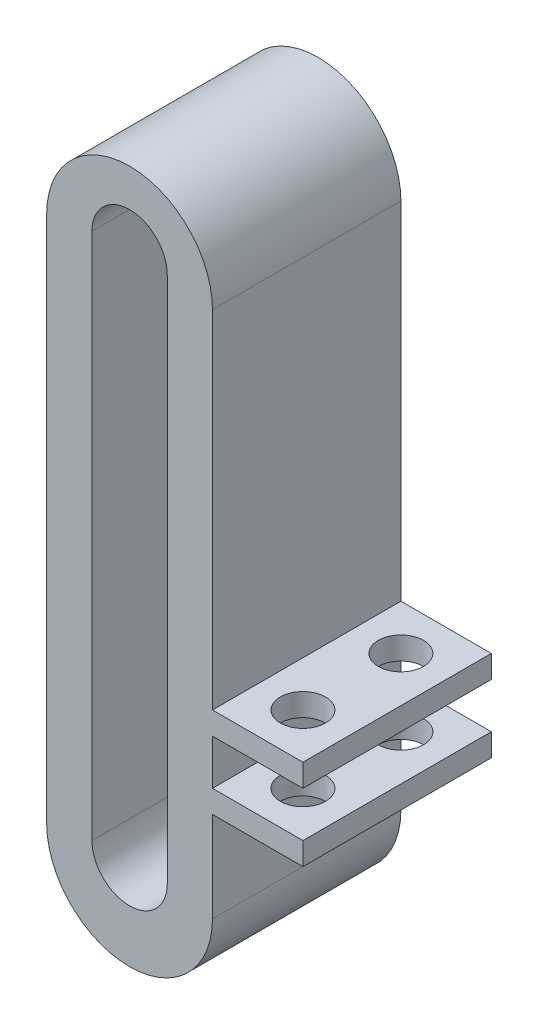
ISO-10303-21;
HEADER;
FILE_DESCRIPTION(('STEP AP214'),'2;1');
FILE_NAME('part.step','',(''),(''),'','','');
FILE_SCHEMA(('AUTOMOTIVE_DESIGN { 1 0 10303 214 1 1 1 1 }'));
ENDSEC;
DATA;
#1=APPLICATION_CONTEXT('core data for automotive mechanical design processes');
#2=APPLICATION_PROTOCOL_DEFINITION('international standard','automotive_design',2000,#1);
#3=PRODUCT_CONTEXT('',#1,'mechanical');
#4=PRODUCT('Part','Part','',(#3));
#5=PRODUCT_RELATED_PRODUCT_CATEGORY('part','',(#4));
#6=PRODUCT_DEFINITION_FORMATION('','',#4);
#7=PRODUCT_DEFINITION_CONTEXT('part definition',#1,'design');
#8=PRODUCT_DEFINITION('design','',#6,#7);
#9=PRODUCT_DEFINITION_SHAPE('','',#8);
#10=(LENGTH_UNIT() NAMED_UNIT(*) SI_UNIT(.MILLI.,.METRE.));
#11=(NAMED_UNIT(*) PLANE_ANGLE_UNIT() SI_UNIT($,.RADIAN.));
#12=(NAMED_UNIT(*) SI_UNIT($,.STERADIAN.) SOLID_ANGLE_UNIT());
#13=UNCERTAINTY_MEASURE_WITH_UNIT(LENGTH_MEASURE(1.E-05),#10,'distance_accuracy_value','');
#14=(GEOMETRIC_REPRESENTATION_CONTEXT(3) GLOBAL_UNCERTAINTY_ASSIGNED_CONTEXT((#13)) GLOBAL_UNIT_ASSIGNED_CONTEXT((#10,
#11,#12)) REPRESENTATION_CONTEXT('',''));
#15=CARTESIAN_POINT('',(0.,0.,0.));
#16=DIRECTION('',(0.,0.,1.));
#17=DIRECTION('',(1.,0.,0.));
#18=AXIS2_PLACEMENT_3D('',#15,#16,#17);
#19=CARTESIAN_POINT('',(5.49999999999977,17.,12.5));
#20=DIRECTION('',(-1.,0.,0.));
#21=DIRECTION('',(0.,0.,1.));
#22=AXIS2_PLACEMENT_3D('',#19,#20,#21);
#23=PLANE('',#22);
#24=DIRECTION('',(0.,0.,-1.));
#25=VECTOR('',#24,1.);
#26=CARTESIAN_POINT('',(5.49999999999977,-7.5,12.5));
#27=LINE('',#26,#25);
#28=CARTESIAN_POINT('',(5.49999999999977,-7.5,12.5));
#29=VERTEX_POINT('',#28);
#30=CARTESIAN_POINT('',(5.49999999999977,-7.5,0.));
#31=VERTEX_POINT('',#30);
#32=EDGE_CURVE('E214',#29,#31,#27,.T.);
#33=ORIENTED_EDGE('',*,*,#32,.F.);
#34=DIRECTION('',(0.,1.,0.));
#35=VECTOR('',#34,1.);
#36=CARTESIAN_POINT('',(5.49999999999977,17.,12.5));
#37=LINE('',#36,#35);
#38=CARTESIAN_POINT('',(5.49999999999977,-10.5,12.5));
#39=VERTEX_POINT('',#38);
#40=EDGE_CURVE('E313',#39,#29,#37,.T.);
#41=ORIENTED_EDGE('',*,*,#40,.F.);
#42=DIRECTION('',(0.,0.,1.));
#43=VECTOR('',#42,1.);
#44=CARTESIAN_POINT('',(5.49999999999977,-10.5,12.5));
#45=LINE('',#44,#43);
#46=CARTESIAN_POINT('',(5.49999999999977,-10.5,0.));
#47=VERTEX_POINT('',#46);
#48=EDGE_CURVE('E246',#47,#39,#45,.T.);
#49=ORIENTED_EDGE('',*,*,#48,.F.);
#50=DIRECTION('',(0.,1.,0.));
#51=VECTOR('',#50,1.);
#52=CARTESIAN_POINT('',(5.49999999999977,17.,0.));
#53=LINE('',#52,#51);
#54=EDGE_CURVE('E322',#47,#31,#53,.T.);
#55=ORIENTED_EDGE('',*,*,#54,.T.);
#56=EDGE_LOOP('',(#33,#41,#49,#55));
#57=FACE_BOUND('',#56,.T.);
#58=ADVANCED_FACE('F35',(#57),#23,.F.);
#59=DIRECTION('',(0.,0.,1.));
#60=VECTOR('',#59,1.);
#61=CARTESIAN_POINT('',(5.49999999999977,-6.,12.5));
#62=LINE('',#61,#60);
#63=CARTESIAN_POINT('',(5.49999999999977,-6.,0.));
#64=VERTEX_POINT('',#63);
#65=CARTESIAN_POINT('',(5.49999999999977,-6.,12.5));
#66=VERTEX_POINT('',#65);
#67=EDGE_CURVE('E219',#64,#66,#62,.T.);
#68=ORIENTED_EDGE('',*,*,#67,.F.);
#69=CARTESIAN_POINT('',(5.49999999999977,17.,0.));
#70=VERTEX_POINT('',#69);
#71=EDGE_CURVE('E320',#64,#70,#53,.T.);
#72=ORIENTED_EDGE('',*,*,#71,.T.);
#73=DIRECTION('',(0.,0.,-1.));
#74=VECTOR('',#73,1.);
#75=CARTESIAN_POINT('',(5.49999999999977,17.,12.5));
#76=LINE('',#75,#74);
#77=CARTESIAN_POINT('',(5.49999999999977,17.,12.5));
#78=VERTEX_POINT('',#77);
#79=EDGE_CURVE('E312',#78,#70,#76,.T.);
#80=ORIENTED_EDGE('',*,*,#79,.F.);
#81=EDGE_CURVE('E308',#66,#78,#37,.T.);
#82=ORIENTED_EDGE('',*,*,#81,.F.);
#83=EDGE_LOOP('',(#68,#72,#80,#82));
#84=FACE_BOUND('',#83,.T.);
#85=ADVANCED_FACE('F363',(#84),#23,.F.);
#86=DIRECTION('',(0.,0.,-1.));
#87=VECTOR('',#86,1.);
#88=CARTESIAN_POINT('',(5.49999999999977,-12.,12.5));
#89=LINE('',#88,#87);
#90=CARTESIAN_POINT('',(5.49999999999977,-12.,12.5));
#91=VERTEX_POINT('',#90);
#92=CARTESIAN_POINT('',(5.49999999999977,-12.,0.));
#93=VERTEX_POINT('',#92);
#94=EDGE_CURVE('E241',#91,#93,#89,.T.);
#95=ORIENTED_EDGE('',*,*,#94,.F.);
#96=CARTESIAN_POINT('',(5.49999999999977,-18.,12.5));
#97=VERTEX_POINT('',#96);
#98=EDGE_CURVE('E309',#97,#91,#37,.T.);
#99=ORIENTED_EDGE('',*,*,#98,.F.);
#100=DIRECTION('',(0.,0.,-1.));
#101=VECTOR('',#100,1.);
#102=CARTESIAN_POINT('',(5.49999999999977,-18.,12.5));
#103=LINE('',#102,#101);
#104=CARTESIAN_POINT('',(5.49999999999977,-18.,0.));
#105=VERTEX_POINT('',#104);
#106=EDGE_CURVE('E325',#97,#105,#103,.T.);
#107=ORIENTED_EDGE('',*,*,#106,.T.);
#108=EDGE_CURVE('E304',#105,#93,#53,.T.);
#109=ORIENTED_EDGE('',*,*,#108,.T.);
#110=EDGE_LOOP('',(#95,#99,#107,#109));
#111=FACE_BOUND('',#110,.T.);
#112=ADVANCED_FACE('F366',(#111),#23,.F.);
#113=CARTESIAN_POINT('',(1.07932326270932E-12,17.0000060128267,12.5));
#114=DIRECTION('',(0.,0.,1.));
#115=DIRECTION('',(1.,0.,0.));
#116=AXIS2_PLACEMENT_3D('',#113,#114,#115);
#117=PLANE('',#116);
#118=CARTESIAN_POINT('',(1.07932326270932E-12,17.0000060128267,12.5));
#119=DIRECTION('',(0.,0.,1.));
#120=DIRECTION('',(1.,0.,0.));
#121=AXIS2_PLACEMENT_3D('',#118,#119,#120);
#122=CIRCLE('',#121,5.50000000000145);
#123=CARTESIAN_POINT('',(-5.49999999999985,17.0000060128267,12.5));
#124=VERTEX_POINT('',#123);
#125=EDGE_CURVE('E300',#78,#124,#122,.T.);
#126=ORIENTED_EDGE('',*,*,#125,.T.);
#127=DIRECTION('',(0.,-1.,0.));
#128=VECTOR('',#127,1.);
#129=CARTESIAN_POINT('',(-5.49999999999985,17.0000060128267,12.5));
#130=LINE('',#129,#128);
#131=CARTESIAN_POINT('',(-5.50000000000022,-17.9999945979283,12.5));
#132=VERTEX_POINT('',#131);
#133=EDGE_CURVE('E303',#124,#132,#130,.T.);
#134=ORIENTED_EDGE('',*,*,#133,.T.);
#135=CARTESIAN_POINT('',(9.21138165743685E-13,-17.9999945979283,12.5));
#136=DIRECTION('',(0.,0.,1.));
#137=DIRECTION('',(1.,0.,0.));
#138=AXIS2_PLACEMENT_3D('',#135,#136,#137);
#139=CIRCLE('',#138,5.50000000000114);
#140=EDGE_CURVE('E306',#132,#97,#139,.T.);
#141=ORIENTED_EDGE('',*,*,#140,.T.);
#142=ORIENTED_EDGE('',*,*,#98,.T.);
#143=DIRECTION('',(-1.,0.,0.));
#144=VECTOR('',#143,1.);
#145=CARTESIAN_POINT('',(11.4999999999998,-12.,12.5));
#146=LINE('',#145,#144);
#147=CARTESIAN_POINT('',(11.4999999999998,-12.,12.5));
#148=VERTEX_POINT('',#147);
#149=EDGE_CURVE('E265',#148,#91,#146,.T.);
#150=ORIENTED_EDGE('',*,*,#149,.F.);
#151=DIRECTION('',(0.,-1.,0.));
#152=VECTOR('',#151,1.);
#153=CARTESIAN_POINT('',(11.4999999999998,-12.,12.5));
#154=LINE('',#153,#152);
#155=CARTESIAN_POINT('',(11.4999999999998,-10.5,12.5));
#156=VERTEX_POINT('',#155);
#157=EDGE_CURVE('E242',#156,#148,#154,.T.);
#158=ORIENTED_EDGE('',*,*,#157,.F.);
#159=DIRECTION('',(-1.,0.,0.));
#160=VECTOR('',#159,1.);
#161=CARTESIAN_POINT('',(11.4999999999998,-10.5,12.5));
#162=LINE('',#161,#160);
#163=EDGE_CURVE('E252',#156,#39,#162,.T.);
#164=ORIENTED_EDGE('',*,*,#163,.T.);
#165=ORIENTED_EDGE('',*,*,#40,.T.);
#166=DIRECTION('',(-1.,0.,0.));
#167=VECTOR('',#166,1.);
#168=CARTESIAN_POINT('',(11.4999999999998,-7.5,12.5));
#169=LINE('',#168,#167);
#170=CARTESIAN_POINT('',(11.4999999999998,-7.5,12.5));
#171=VERTEX_POINT('',#170);
#172=EDGE_CURVE('E238',#171,#29,#169,.T.);
#173=ORIENTED_EDGE('',*,*,#172,.F.);
#174=DIRECTION('',(0.,-1.,0.));
#175=VECTOR('',#174,1.);
#176=CARTESIAN_POINT('',(11.4999999999998,-6.,12.5));
#177=LINE('',#176,#175);
#178=CARTESIAN_POINT('',(11.4999999999998,-6.,12.5));
#179=VERTEX_POINT('',#178);
#180=EDGE_CURVE('E215',#179,#171,#177,.T.);
#181=ORIENTED_EDGE('',*,*,#180,.F.);
#182=DIRECTION('',(-1.,0.,0.));
#183=VECTOR('',#182,1.);
#184=CARTESIAN_POINT('',(11.4999999999998,-6.,12.5));
#185=LINE('',#184,#183);
#186=EDGE_CURVE('E225',#179,#66,#185,.T.);
#187=ORIENTED_EDGE('',*,*,#186,.T.);
#188=ORIENTED_EDGE('',*,*,#81,.T.);
#189=EDGE_LOOP('',(#126,#134,#141,#142,#150,#158,#164,#165,#173,#181,#187,#188));
#190=FACE_BOUND('',#189,.T.);
#191=DIRECTION('',(0.,-1.,0.));
#192=VECTOR('',#191,1.);
#193=CARTESIAN_POINT('',(-2.49999999999984,17.5,12.5));
#194=LINE('',#193,#192);
#195=CARTESIAN_POINT('',(-2.49999999999984,17.5,12.5));
#196=VERTEX_POINT('',#195);
#197=CARTESIAN_POINT('',(-2.49999999999984,-17.5,12.5));
#198=VERTEX_POINT('',#197);
#199=EDGE_CURVE('E271',#196,#198,#194,.T.);
#200=ORIENTED_EDGE('',*,*,#199,.F.);
#201=CARTESIAN_POINT('',(0.,17.5,12.5));
#202=DIRECTION('',(0.,0.,1.));
#203=DIRECTION('',(1.,0.,0.));
#204=AXIS2_PLACEMENT_3D('',#201,#202,#203);
#205=CIRCLE('',#204,2.49999999999983);
#206=CARTESIAN_POINT('',(2.49999999999982,17.5,12.5));
#207=VERTEX_POINT('',#206);
#208=EDGE_CURVE('E269',#207,#196,#205,.T.);
#209=ORIENTED_EDGE('',*,*,#208,.F.);
#210=DIRECTION('',(0.,1.,0.));
#211=VECTOR('',#210,1.);
#212=CARTESIAN_POINT('',(2.49999999999982,17.5,12.5));
#213=LINE('',#212,#211);
#214=CARTESIAN_POINT('',(2.49999999999983,-17.5,12.5));
#215=VERTEX_POINT('',#214);
#216=EDGE_CURVE('E277',#215,#207,#213,.T.);
#217=ORIENTED_EDGE('',*,*,#216,.F.);
#218=CARTESIAN_POINT('',(0.,-17.5,12.5));
#219=DIRECTION('',(0.,0.,1.));
#220=DIRECTION('',(1.,0.,0.));
#221=AXIS2_PLACEMENT_3D('',#218,#219,#220);
#222=CIRCLE('',#221,2.49999999999984);
#223=EDGE_CURVE('E274',#198,#215,#222,.T.);
#224=ORIENTED_EDGE('',*,*,#223,.F.);
#225=EDGE_LOOP('',(#200,#209,#217,#224));
#226=FACE_BOUND('',#225,.T.);
#227=ADVANCED_FACE('F374',(#190,#226),#117,.T.);
#228=CARTESIAN_POINT('',(1.07932326270932E-12,17.0000060128267,0.));
#229=DIRECTION('',(0.,0.,1.));
#230=DIRECTION('',(1.,0.,0.));
#231=AXIS2_PLACEMENT_3D('',#228,#229,#230);
#232=PLANE('',#231);
#233=CARTESIAN_POINT('',(1.07932326270932E-12,17.0000060128267,0.));
#234=DIRECTION('',(0.,0.,1.));
#235=DIRECTION('',(1.,0.,0.));
#236=AXIS2_PLACEMENT_3D('',#233,#234,#235);
#237=CIRCLE('',#236,5.50000000000145);
#238=CARTESIAN_POINT('',(-5.49999999999985,17.0000060128267,0.));
#239=VERTEX_POINT('',#238);
#240=EDGE_CURVE('E299',#70,#239,#237,.T.);
#241=ORIENTED_EDGE('',*,*,#240,.F.);
#242=ORIENTED_EDGE('',*,*,#71,.F.);
#243=DIRECTION('',(-1.,0.,0.));
#244=VECTOR('',#243,1.);
#245=CARTESIAN_POINT('',(11.4999999999998,-6.,0.));
#246=LINE('',#245,#244);
#247=CARTESIAN_POINT('',(11.4999999999998,-6.,0.));
#248=VERTEX_POINT('',#247);
#249=EDGE_CURVE('E232',#248,#64,#246,.T.);
#250=ORIENTED_EDGE('',*,*,#249,.F.);
#251=DIRECTION('',(0.,1.,0.));
#252=VECTOR('',#251,1.);
#253=CARTESIAN_POINT('',(11.4999999999998,-6.,0.));
#254=LINE('',#253,#252);
#255=CARTESIAN_POINT('',(11.4999999999998,-7.5,0.));
#256=VERTEX_POINT('',#255);
#257=EDGE_CURVE('E221',#256,#248,#254,.T.);
#258=ORIENTED_EDGE('',*,*,#257,.F.);
#259=DIRECTION('',(-1.,0.,0.));
#260=VECTOR('',#259,1.);
#261=CARTESIAN_POINT('',(11.4999999999998,-7.5,0.));
#262=LINE('',#261,#260);
#263=EDGE_CURVE('E235',#256,#31,#262,.T.);
#264=ORIENTED_EDGE('',*,*,#263,.T.);
#265=ORIENTED_EDGE('',*,*,#54,.F.);
#266=DIRECTION('',(-1.,0.,0.));
#267=VECTOR('',#266,1.);
#268=CARTESIAN_POINT('',(11.4999999999998,-10.5,0.));
#269=LINE('',#268,#267);
#270=CARTESIAN_POINT('',(11.4999999999998,-10.5,0.));
#271=VERTEX_POINT('',#270);
#272=EDGE_CURVE('E259',#271,#47,#269,.T.);
#273=ORIENTED_EDGE('',*,*,#272,.F.);
#274=DIRECTION('',(0.,1.,0.));
#275=VECTOR('',#274,1.);
#276=CARTESIAN_POINT('',(11.4999999999998,-12.,0.));
#277=LINE('',#276,#275);
#278=CARTESIAN_POINT('',(11.4999999999998,-12.,0.));
#279=VERTEX_POINT('',#278);
#280=EDGE_CURVE('E248',#279,#271,#277,.T.);
#281=ORIENTED_EDGE('',*,*,#280,.F.);
#282=DIRECTION('',(-1.,0.,0.));
#283=VECTOR('',#282,1.);
#284=CARTESIAN_POINT('',(11.4999999999998,-12.,0.));
#285=LINE('',#284,#283);
#286=EDGE_CURVE('E262',#279,#93,#285,.T.);
#287=ORIENTED_EDGE('',*,*,#286,.T.);
#288=ORIENTED_EDGE('',*,*,#108,.F.);
#289=CARTESIAN_POINT('',(9.21138165743685E-13,-17.9999945979283,0.));
#290=DIRECTION('',(0.,0.,1.));
#291=DIRECTION('',(1.,0.,0.));
#292=AXIS2_PLACEMENT_3D('',#289,#290,#291);
#293=CIRCLE('',#292,5.50000000000114);
#294=CARTESIAN_POINT('',(-5.50000000000022,-17.9999945979283,0.));
#295=VERTEX_POINT('',#294);
#296=EDGE_CURVE('E318',#295,#105,#293,.T.);
#297=ORIENTED_EDGE('',*,*,#296,.F.);
#298=DIRECTION('',(0.,-1.,0.));
#299=VECTOR('',#298,1.);
#300=CARTESIAN_POINT('',(-5.49999999999985,17.0000060128267,0.));
#301=LINE('',#300,#299);
#302=EDGE_CURVE('E316',#239,#295,#301,.T.);
#303=ORIENTED_EDGE('',*,*,#302,.F.);
#304=EDGE_LOOP('',(#241,#242,#250,#258,#264,#265,#273,#281,#287,#288,#297,#303));
#305=FACE_BOUND('',#304,.T.);
#306=CARTESIAN_POINT('',(0.,17.5,0.));
#307=DIRECTION('',(0.,0.,1.));
#308=DIRECTION('',(1.,0.,0.));
#309=AXIS2_PLACEMENT_3D('',#306,#307,#308);
#310=CIRCLE('',#309,2.49999999999983);
#311=CARTESIAN_POINT('',(2.49999999999982,17.5,0.));
#312=VERTEX_POINT('',#311);
#313=CARTESIAN_POINT('',(-2.49999999999984,17.5,0.));
#314=VERTEX_POINT('',#313);
#315=EDGE_CURVE('E268',#312,#314,#310,.T.);
#316=ORIENTED_EDGE('',*,*,#315,.T.);
#317=DIRECTION('',(0.,-1.,0.));
#318=VECTOR('',#317,1.);
#319=CARTESIAN_POINT('',(-2.49999999999984,17.5,0.));
#320=LINE('',#319,#318);
#321=CARTESIAN_POINT('',(-2.49999999999984,-17.5,0.));
#322=VERTEX_POINT('',#321);
#323=EDGE_CURVE('E282',#314,#322,#320,.T.);
#324=ORIENTED_EDGE('',*,*,#323,.T.);
#325=CARTESIAN_POINT('',(0.,-17.5,0.));
#326=DIRECTION('',(0.,0.,1.));
#327=DIRECTION('',(1.,0.,0.));
#328=AXIS2_PLACEMENT_3D('',#325,#326,#327);
#329=CIRCLE('',#328,2.49999999999984);
#330=CARTESIAN_POINT('',(2.49999999999983,-17.5,0.));
#331=VERTEX_POINT('',#330);
#332=EDGE_CURVE('E285',#322,#331,#329,.T.);
#333=ORIENTED_EDGE('',*,*,#332,.T.);
#334=DIRECTION('',(0.,1.,0.));
#335=VECTOR('',#334,1.);
#336=CARTESIAN_POINT('',(2.49999999999982,17.5,0.));
#337=LINE('',#336,#335);
#338=EDGE_CURVE('E272',#331,#312,#337,.T.);
#339=ORIENTED_EDGE('',*,*,#338,.T.);
#340=EDGE_LOOP('',(#316,#324,#333,#339));
#341=FACE_BOUND('',#340,.T.);
#342=ADVANCED_FACE('F379',(#305,#341),#232,.F.);
#343=CARTESIAN_POINT('',(1.07932326270932E-12,17.0000060128267,12.5));
#344=DIRECTION('',(0.,0.,-1.));
#345=DIRECTION('',(-1.,0.,0.));
#346=AXIS2_PLACEMENT_3D('',#343,#344,#345);
#347=CYLINDRICAL_SURFACE('',#346,5.50000000000145);
#348=ORIENTED_EDGE('',*,*,#240,.T.);
#349=DIRECTION('',(0.,0.,-1.));
#350=VECTOR('',#349,1.);
#351=CARTESIAN_POINT('',(-5.49999999999985,17.0000060128267,12.5));
#352=LINE('',#351,#350);
#353=EDGE_CURVE('E331',#124,#239,#352,.T.);
#354=ORIENTED_EDGE('',*,*,#353,.F.);
#355=ORIENTED_EDGE('',*,*,#125,.F.);
#356=ORIENTED_EDGE('',*,*,#79,.T.);
#357=EDGE_LOOP('',(#348,#354,#355,#356));
#358=FACE_BOUND('',#357,.T.);
#359=ADVANCED_FACE('F37',(#358),#347,.T.);
#360=CARTESIAN_POINT('',(-5.49999999999985,17.0000060128267,12.5));
#361=DIRECTION('',(1.,0.,0.));
#362=DIRECTION('',(0.,1.,0.));
#363=AXIS2_PLACEMENT_3D('',#360,#361,#362);
#364=PLANE('',#363);
#365=ORIENTED_EDGE('',*,*,#302,.T.);
#366=DIRECTION('',(0.,0.,-1.));
#367=VECTOR('',#366,1.);
#368=CARTESIAN_POINT('',(-5.50000000000022,-17.9999945979283,12.5));
#369=LINE('',#368,#367);
#370=EDGE_CURVE('E328',#132,#295,#369,.T.);
#371=ORIENTED_EDGE('',*,*,#370,.F.);
#372=ORIENTED_EDGE('',*,*,#133,.F.);
#373=ORIENTED_EDGE('',*,*,#353,.T.);
#374=EDGE_LOOP('',(#365,#371,#372,#373));
#375=FACE_BOUND('',#374,.T.);
#376=ADVANCED_FACE('F417',(#375),#364,.F.);
#377=CARTESIAN_POINT('',(9.21138165743685E-13,-17.9999945979283,12.5));
#378=DIRECTION('',(0.,0.,-1.));
#379=DIRECTION('',(-1.,0.,0.));
#380=AXIS2_PLACEMENT_3D('',#377,#378,#379);
#381=CYLINDRICAL_SURFACE('',#380,5.50000000000114);
#382=DIRECTION('',(0.,0.,-1.));
#383=VECTOR('',#382,1.);
#384=CARTESIAN_POINT('',(-0.49999999999985,-23.477220172981,12.5));
#385=LINE('',#384,#383);
#386=CARTESIAN_POINT('',(-0.499999999999851,-23.477220172981,3.75));
#387=VERTEX_POINT('',#386);
#388=CARTESIAN_POINT('',(-0.499999999999851,-23.477220172981,8.75));
#389=VERTEX_POINT('',#388);
#390=EDGE_CURVE('E180',#387,#389,#385,.F.);
#391=ORIENTED_EDGE('',*,*,#390,.T.);
#392=CARTESIAN_POINT('',(9.21138165743685E-13,-17.9999945979283,8.75));
#393=DIRECTION('',(0.,0.,1.));
#394=DIRECTION('',(1.,0.,0.));
#395=AXIS2_PLACEMENT_3D('',#392,#393,#394);
#396=CIRCLE('',#395,5.50000000000114);
#397=CARTESIAN_POINT('',(0.50000000000015,-23.4772201729812,8.75));
#398=VERTEX_POINT('',#397);
#399=EDGE_CURVE('E50',#389,#398,#396,.T.);
#400=ORIENTED_EDGE('',*,*,#399,.T.);
#401=DIRECTION('',(0.,0.,-1.));
#402=VECTOR('',#401,1.);
#403=CARTESIAN_POINT('',(0.50000000000015,-23.4772201729812,12.5));
#404=LINE('',#403,#402);
#405=CARTESIAN_POINT('',(0.500000000000149,-23.4772201729812,3.75));
#406=VERTEX_POINT('',#405);
#407=EDGE_CURVE('E173',#398,#406,#404,.T.);
#408=ORIENTED_EDGE('',*,*,#407,.T.);
#409=CARTESIAN_POINT('',(9.21138165743685E-13,-17.9999945979283,3.75));
#410=DIRECTION('',(0.,0.,-1.));
#411=DIRECTION('',(-1.,0.,0.));
#412=AXIS2_PLACEMENT_3D('',#409,#410,#411);
#413=CIRCLE('',#412,5.50000000000114);
#414=EDGE_CURVE('E187',#406,#387,#413,.T.);
#415=ORIENTED_EDGE('',*,*,#414,.T.);
#416=EDGE_LOOP('',(#391,#400,#408,#415));
#417=FACE_BOUND('',#416,.T.);
#418=ORIENTED_EDGE('',*,*,#296,.T.);
#419=ORIENTED_EDGE('',*,*,#106,.F.);
#420=ORIENTED_EDGE('',*,*,#140,.F.);
#421=ORIENTED_EDGE('',*,*,#370,.T.);
#422=EDGE_LOOP('',(#418,#419,#420,#421));
#423=FACE_BOUND('',#422,.T.);
#424=ADVANCED_FACE('F185',(#417,#423),#381,.T.);
#425=CARTESIAN_POINT('',(0.,17.5,12.5));
#426=DIRECTION('',(0.,0.,-1.));
#427=DIRECTION('',(-1.,0.,0.));
#428=AXIS2_PLACEMENT_3D('',#425,#426,#427);
#429=CYLINDRICAL_SURFACE('',#428,2.49999999999983);
#430=ORIENTED_EDGE('',*,*,#315,.F.);
#431=DIRECTION('',(0.,0.,-1.));
#432=VECTOR('',#431,1.);
#433=CARTESIAN_POINT('',(2.49999999999982,17.5,12.5));
#434=LINE('',#433,#432);
#435=EDGE_CURVE('E279',#207,#312,#434,.T.);
#436=ORIENTED_EDGE('',*,*,#435,.F.);
#437=ORIENTED_EDGE('',*,*,#208,.T.);
#438=DIRECTION('',(0.,0.,-1.));
#439=VECTOR('',#438,1.);
#440=CARTESIAN_POINT('',(-2.49999999999984,17.5,12.5));
#441=LINE('',#440,#439);
#442=EDGE_CURVE('E296',#196,#314,#441,.T.);
#443=ORIENTED_EDGE('',*,*,#442,.T.);
#444=EDGE_LOOP('',(#430,#436,#437,#443));
#445=FACE_BOUND('',#444,.T.);
#446=ADVANCED_FACE('F455',(#445),#429,.F.);
#447=CARTESIAN_POINT('',(-2.49999999999984,17.5,12.5));
#448=DIRECTION('',(1.,0.,0.));
#449=DIRECTION('',(0.,0.,-1.));
#450=AXIS2_PLACEMENT_3D('',#447,#448,#449);
#451=PLANE('',#450);
#452=ORIENTED_EDGE('',*,*,#323,.F.);
#453=ORIENTED_EDGE('',*,*,#442,.F.);
#454=ORIENTED_EDGE('',*,*,#199,.T.);
#455=DIRECTION('',(0.,0.,-1.));
#456=VECTOR('',#455,1.);
#457=CARTESIAN_POINT('',(-2.49999999999984,-17.5,12.5));
#458=LINE('',#457,#456);
#459=EDGE_CURVE('E294',#198,#322,#458,.T.);
#460=ORIENTED_EDGE('',*,*,#459,.T.);
#461=EDGE_LOOP('',(#452,#453,#454,#460));
#462=FACE_BOUND('',#461,.T.);
#463=ADVANCED_FACE('F452',(#462),#451,.T.);
#464=CARTESIAN_POINT('',(0.,-17.5,12.5));
#465=DIRECTION('',(0.,0.,-1.));
#466=DIRECTION('',(-1.,0.,0.));
#467=AXIS2_PLACEMENT_3D('',#464,#465,#466);
#468=CYLINDRICAL_SURFACE('',#467,2.49999999999984);
#469=DIRECTION('',(0.,0.,-1.));
#470=VECTOR('',#469,1.);
#471=CARTESIAN_POINT('',(-0.49999999999985,-19.949489742783,12.5));
#472=LINE('',#471,#470);
#473=CARTESIAN_POINT('',(-0.499999999999851,-19.949489742783,3.75));
#474=VERTEX_POINT('',#473);
#475=CARTESIAN_POINT('',(-0.499999999999851,-19.949489742783,8.75));
#476=VERTEX_POINT('',#475);
#477=EDGE_CURVE('E11',#474,#476,#472,.F.);
#478=ORIENTED_EDGE('',*,*,#477,.F.);
#479=CARTESIAN_POINT('',(0.,-17.5,3.75));
#480=DIRECTION('',(0.,0.,-1.));
#481=DIRECTION('',(-1.,0.,0.));
#482=AXIS2_PLACEMENT_3D('',#479,#480,#481);
#483=CIRCLE('',#482,2.49999999999984);
#484=CARTESIAN_POINT('',(0.500000000000149,-19.949489742783,3.75));
#485=VERTEX_POINT('',#484);
#486=EDGE_CURVE('E43',#485,#474,#483,.T.);
#487=ORIENTED_EDGE('',*,*,#486,.F.);
#488=DIRECTION('',(0.,0.,-1.));
#489=VECTOR('',#488,1.);
#490=CARTESIAN_POINT('',(0.50000000000015,-19.949489742783,12.5));
#491=LINE('',#490,#489);
#492=CARTESIAN_POINT('',(0.50000000000015,-19.949489742783,8.75));
#493=VERTEX_POINT('',#492);
#494=EDGE_CURVE('E338',#493,#485,#491,.T.);
#495=ORIENTED_EDGE('',*,*,#494,.F.);
#496=CARTESIAN_POINT('',(0.,-17.5,8.75));
#497=DIRECTION('',(0.,0.,1.));
#498=DIRECTION('',(1.,0.,0.));
#499=AXIS2_PLACEMENT_3D('',#496,#497,#498);
#500=CIRCLE('',#499,2.49999999999984);
#501=EDGE_CURVE('E333',#476,#493,#500,.T.);
#502=ORIENTED_EDGE('',*,*,#501,.F.);
#503=EDGE_LOOP('',(#478,#487,#495,#502));
#504=FACE_BOUND('',#503,.T.);
#505=ORIENTED_EDGE('',*,*,#332,.F.);
#506=ORIENTED_EDGE('',*,*,#459,.F.);
#507=ORIENTED_EDGE('',*,*,#223,.T.);
#508=DIRECTION('',(0.,0.,-1.));
#509=VECTOR('',#508,1.);
#510=CARTESIAN_POINT('',(2.49999999999983,-17.5,12.5));
#511=LINE('',#510,#509);
#512=EDGE_CURVE('E292',#215,#331,#511,.T.);
#513=ORIENTED_EDGE('',*,*,#512,.T.);
#514=EDGE_LOOP('',(#505,#506,#507,#513));
#515=FACE_BOUND('',#514,.T.);
#516=ADVANCED_FACE('F348',(#504,#515),#468,.F.);
#517=CARTESIAN_POINT('',(2.49999999999982,17.5,12.5));
#518=DIRECTION('',(-1.,0.,0.));
#519=DIRECTION('',(0.,-1.,0.));
#520=AXIS2_PLACEMENT_3D('',#517,#518,#519);
#521=PLANE('',#520);
#522=ORIENTED_EDGE('',*,*,#338,.F.);
#523=ORIENTED_EDGE('',*,*,#512,.F.);
#524=ORIENTED_EDGE('',*,*,#216,.T.);
#525=ORIENTED_EDGE('',*,*,#435,.T.);
#526=EDGE_LOOP('',(#522,#523,#524,#525));
#527=FACE_BOUND('',#526,.T.);
#528=ADVANCED_FACE('F445',(#527),#521,.T.);
#529=CARTESIAN_POINT('',(11.4999999999998,-12.,12.5));
#530=DIRECTION('',(0.,1.,0.));
#531=DIRECTION('',(-1.,0.,0.));
#532=AXIS2_PLACEMENT_3D('',#529,#530,#531);
#533=PLANE('',#532);
#534=CARTESIAN_POINT('',(8.49999999999977,-12.,3.));
#535=DIRECTION('',(0.,1.,0.));
#536=DIRECTION('',(-1.,0.,0.));
#537=AXIS2_PLACEMENT_3D('',#534,#535,#536);
#538=CIRCLE('',#537,1.5);
#539=CARTESIAN_POINT('',(6.99999999999977,-12.,3.));
#540=VERTEX_POINT('',#539);
#541=EDGE_CURVE('E211',#540,#540,#538,.T.);
#542=ORIENTED_EDGE('',*,*,#541,.T.);
#543=EDGE_LOOP('',(#542));
#544=FACE_BOUND('',#543,.T.);
#545=CARTESIAN_POINT('',(8.49999999999977,-12.,9.5));
#546=DIRECTION('',(0.,1.,0.));
#547=DIRECTION('',(-1.,0.,0.));
#548=AXIS2_PLACEMENT_3D('',#545,#546,#547);
#549=CIRCLE('',#548,1.5);
#550=CARTESIAN_POINT('',(6.99999999999977,-12.,9.5));
#551=VERTEX_POINT('',#550);
#552=EDGE_CURVE('E201',#551,#551,#549,.T.);
#553=ORIENTED_EDGE('',*,*,#552,.T.);
#554=EDGE_LOOP('',(#553));
#555=FACE_BOUND('',#554,.T.);
#556=ORIENTED_EDGE('',*,*,#94,.T.);
#557=ORIENTED_EDGE('',*,*,#286,.F.);
#558=DIRECTION('',(0.,0.,-1.));
#559=VECTOR('',#558,1.);
#560=CARTESIAN_POINT('',(11.4999999999998,-12.,12.5));
#561=LINE('',#560,#559);
#562=EDGE_CURVE('E245',#148,#279,#561,.T.);
#563=ORIENTED_EDGE('',*,*,#562,.F.);
#564=ORIENTED_EDGE('',*,*,#149,.T.);
#565=EDGE_LOOP('',(#556,#557,#563,#564));
#566=FACE_BOUND('',#565,.T.);
#567=ADVANCED_FACE('F391',(#544,#555,#566),#533,.F.);
#568=CARTESIAN_POINT('',(11.4999999999998,-10.5,12.5));
#569=DIRECTION('',(0.,-1.,0.));
#570=DIRECTION('',(1.,0.,0.));
#571=AXIS2_PLACEMENT_3D('',#568,#569,#570);
#572=PLANE('',#571);
#573=CARTESIAN_POINT('',(8.49999999999977,-10.5,3.));
#574=DIRECTION('',(0.,-1.,0.));
#575=DIRECTION('',(1.,0.,0.));
#576=AXIS2_PLACEMENT_3D('',#573,#574,#575);
#577=CIRCLE('',#576,1.5);
#578=CARTESIAN_POINT('',(9.99999999999977,-10.5,3.));
#579=VERTEX_POINT('',#578);
#580=EDGE_CURVE('E208',#579,#579,#577,.T.);
#581=ORIENTED_EDGE('',*,*,#580,.T.);
#582=EDGE_LOOP('',(#581));
#583=FACE_BOUND('',#582,.T.);
#584=CARTESIAN_POINT('',(8.49999999999977,-10.5,9.5));
#585=DIRECTION('',(0.,-1.,0.));
#586=DIRECTION('',(1.,0.,0.));
#587=AXIS2_PLACEMENT_3D('',#584,#585,#586);
#588=CIRCLE('',#587,1.5);
#589=CARTESIAN_POINT('',(9.99999999999977,-10.5,9.5));
#590=VERTEX_POINT('',#589);
#591=EDGE_CURVE('E198',#590,#590,#588,.T.);
#592=ORIENTED_EDGE('',*,*,#591,.T.);
#593=EDGE_LOOP('',(#592));
#594=FACE_BOUND('',#593,.T.);
#595=ORIENTED_EDGE('',*,*,#48,.T.);
#596=ORIENTED_EDGE('',*,*,#163,.F.);
#597=DIRECTION('',(0.,0.,1.));
#598=VECTOR('',#597,1.);
#599=CARTESIAN_POINT('',(11.4999999999998,-10.5,12.5));
#600=LINE('',#599,#598);
#601=EDGE_CURVE('E250',#271,#156,#600,.T.);
#602=ORIENTED_EDGE('',*,*,#601,.F.);
#603=ORIENTED_EDGE('',*,*,#272,.T.);
#604=EDGE_LOOP('',(#595,#596,#602,#603));
#605=FACE_BOUND('',#604,.T.);
#606=ADVANCED_FACE('F400',(#583,#594,#605),#572,.F.);
#607=CARTESIAN_POINT('',(11.4999999999998,0.,0.));
#608=DIRECTION('',(-1.,0.,0.));
#609=DIRECTION('',(0.,0.,1.));
#610=AXIS2_PLACEMENT_3D('',#607,#608,#609);
#611=PLANE('',#610);
#612=ORIENTED_EDGE('',*,*,#157,.T.);
#613=ORIENTED_EDGE('',*,*,#562,.T.);
#614=ORIENTED_EDGE('',*,*,#280,.T.);
#615=ORIENTED_EDGE('',*,*,#601,.T.);
#616=EDGE_LOOP('',(#612,#613,#614,#615));
#617=FACE_BOUND('',#616,.T.);
#618=ADVANCED_FACE('F394',(#617),#611,.F.);
#619=CARTESIAN_POINT('',(11.4999999999998,-7.5,12.5));
#620=DIRECTION('',(0.,1.,0.));
#621=DIRECTION('',(-1.,0.,0.));
#622=AXIS2_PLACEMENT_3D('',#619,#620,#621);
#623=PLANE('',#622);
#624=CARTESIAN_POINT('',(8.49999999999977,-7.5,3.));
#625=DIRECTION('',(0.,1.,0.));
#626=DIRECTION('',(-1.,0.,0.));
#627=AXIS2_PLACEMENT_3D('',#624,#625,#626);
#628=CIRCLE('',#627,1.5);
#629=CARTESIAN_POINT('',(6.99999999999977,-7.5,3.));
#630=VERTEX_POINT('',#629);
#631=EDGE_CURVE('E205',#630,#630,#628,.T.);
#632=ORIENTED_EDGE('',*,*,#631,.T.);
#633=EDGE_LOOP('',(#632));
#634=FACE_BOUND('',#633,.T.);
#635=CARTESIAN_POINT('',(8.49999999999977,-7.5,9.5));
#636=DIRECTION('',(0.,1.,0.));
#637=DIRECTION('',(-1.,0.,0.));
#638=AXIS2_PLACEMENT_3D('',#635,#636,#637);
#639=CIRCLE('',#638,1.5);
#640=CARTESIAN_POINT('',(6.99999999999977,-7.5,9.5));
#641=VERTEX_POINT('',#640);
#642=EDGE_CURVE('E191',#641,#641,#639,.T.);
#643=ORIENTED_EDGE('',*,*,#642,.T.);
#644=EDGE_LOOP('',(#643));
#645=FACE_BOUND('',#644,.T.);
#646=ORIENTED_EDGE('',*,*,#32,.T.);
#647=ORIENTED_EDGE('',*,*,#263,.F.);
#648=DIRECTION('',(0.,0.,-1.));
#649=VECTOR('',#648,1.);
#650=CARTESIAN_POINT('',(11.4999999999998,-7.5,12.5));
#651=LINE('',#650,#649);
#652=EDGE_CURVE('E218',#171,#256,#651,.T.);
#653=ORIENTED_EDGE('',*,*,#652,.F.);
#654=ORIENTED_EDGE('',*,*,#172,.T.);
#655=EDGE_LOOP('',(#646,#647,#653,#654));
#656=FACE_BOUND('',#655,.T.);
#657=ADVANCED_FACE('F426',(#634,#645,#656),#623,.F.);
#658=CARTESIAN_POINT('',(11.4999999999998,-6.,12.5));
#659=DIRECTION('',(0.,-1.,0.));
#660=DIRECTION('',(1.,0.,0.));
#661=AXIS2_PLACEMENT_3D('',#658,#659,#660);
#662=PLANE('',#661);
#663=CARTESIAN_POINT('',(8.49999999999977,-6.,3.));
#664=DIRECTION('',(0.,-1.,0.));
#665=DIRECTION('',(1.,0.,0.));
#666=AXIS2_PLACEMENT_3D('',#663,#664,#665);
#667=CIRCLE('',#666,1.5);
#668=CARTESIAN_POINT('',(9.99999999999977,-6.,3.));
#669=VERTEX_POINT('',#668);
#670=EDGE_CURVE('E204',#669,#669,#667,.T.);
#671=ORIENTED_EDGE('',*,*,#670,.T.);
#672=EDGE_LOOP('',(#671));
#673=FACE_BOUND('',#672,.T.);
#674=CARTESIAN_POINT('',(8.49999999999977,-6.,9.5));
#675=DIRECTION('',(0.,-1.,0.));
#676=DIRECTION('',(1.,0.,0.));
#677=AXIS2_PLACEMENT_3D('',#674,#675,#676);
#678=CIRCLE('',#677,1.5);
#679=CARTESIAN_POINT('',(9.99999999999977,-6.,9.5));
#680=VERTEX_POINT('',#679);
#681=EDGE_CURVE('E188',#680,#680,#678,.T.);
#682=ORIENTED_EDGE('',*,*,#681,.T.);
#683=EDGE_LOOP('',(#682));
#684=FACE_BOUND('',#683,.T.);
#685=ORIENTED_EDGE('',*,*,#67,.T.);
#686=ORIENTED_EDGE('',*,*,#186,.F.);
#687=DIRECTION('',(0.,0.,1.));
#688=VECTOR('',#687,1.);
#689=CARTESIAN_POINT('',(11.4999999999998,-6.,12.5));
#690=LINE('',#689,#688);
#691=EDGE_CURVE('E223',#248,#179,#690,.T.);
#692=ORIENTED_EDGE('',*,*,#691,.F.);
#693=ORIENTED_EDGE('',*,*,#249,.T.);
#694=EDGE_LOOP('',(#685,#686,#692,#693));
#695=FACE_BOUND('',#694,.T.);
#696=ADVANCED_FACE('F421',(#673,#684,#695),#662,.F.);
#697=CARTESIAN_POINT('',(11.4999999999998,0.,0.));
#698=DIRECTION('',(1.,0.,0.));
#699=DIRECTION('',(0.,0.,-1.));
#700=AXIS2_PLACEMENT_3D('',#697,#698,#699);
#701=PLANE('',#700);
#702=ORIENTED_EDGE('',*,*,#180,.T.);
#703=ORIENTED_EDGE('',*,*,#652,.T.);
#704=ORIENTED_EDGE('',*,*,#257,.T.);
#705=ORIENTED_EDGE('',*,*,#691,.T.);
#706=EDGE_LOOP('',(#702,#703,#704,#705));
#707=FACE_BOUND('',#706,.T.);
#708=ADVANCED_FACE('F424',(#707),#701,.T.);
#709=CARTESIAN_POINT('',(8.49999999999977,-23.4999945979295,9.5));
#710=DIRECTION('',(0.,1.,0.));
#711=DIRECTION('',(-1.,0.,0.));
#712=AXIS2_PLACEMENT_3D('',#709,#710,#711);
#713=CYLINDRICAL_SURFACE('',#712,1.5);
#714=ORIENTED_EDGE('',*,*,#681,.F.);
#715=EDGE_LOOP('',(#714));
#716=FACE_BOUND('',#715,.T.);
#717=ORIENTED_EDGE('',*,*,#642,.F.);
#718=EDGE_LOOP('',(#717));
#719=FACE_BOUND('',#718,.T.);
#720=ADVANCED_FACE('F513',(#716,#719),#713,.F.);
#721=CARTESIAN_POINT('',(8.49999999999977,-23.4999945979295,3.));
#722=DIRECTION('',(0.,1.,0.));
#723=DIRECTION('',(-1.,0.,0.));
#724=AXIS2_PLACEMENT_3D('',#721,#722,#723);
#725=CYLINDRICAL_SURFACE('',#724,1.5);
#726=ORIENTED_EDGE('',*,*,#670,.F.);
#727=EDGE_LOOP('',(#726));
#728=FACE_BOUND('',#727,.T.);
#729=ORIENTED_EDGE('',*,*,#631,.F.);
#730=EDGE_LOOP('',(#729));
#731=FACE_BOUND('',#730,.T.);
#732=ADVANCED_FACE('F525',(#728,#731),#725,.F.);
#733=ORIENTED_EDGE('',*,*,#591,.F.);
#734=EDGE_LOOP('',(#733));
#735=FACE_BOUND('',#734,.T.);
#736=ORIENTED_EDGE('',*,*,#552,.F.);
#737=EDGE_LOOP('',(#736));
#738=FACE_BOUND('',#737,.T.);
#739=ADVANCED_FACE('F528',(#735,#738),#713,.F.);
#740=ORIENTED_EDGE('',*,*,#580,.F.);
#741=EDGE_LOOP('',(#740));
#742=FACE_BOUND('',#741,.T.);
#743=ORIENTED_EDGE('',*,*,#541,.F.);
#744=EDGE_LOOP('',(#743));
#745=FACE_BOUND('',#744,.T.);
#746=ADVANCED_FACE('F535',(#742,#745),#725,.F.);
#747=CARTESIAN_POINT('',(-0.499999999999851,-23.4999945979295,3.75));
#748=DIRECTION('',(-1.,0.,0.));
#749=DIRECTION('',(0.,0.,1.));
#750=AXIS2_PLACEMENT_3D('',#747,#748,#749);
#751=PLANE('',#750);
#752=DIRECTION('',(0.,1.,0.));
#753=VECTOR('',#752,1.);
#754=CARTESIAN_POINT('',(-0.499999999999851,-23.4999945979295,3.75));
#755=LINE('',#754,#753);
#756=EDGE_CURVE('E174',#387,#474,#755,.T.);
#757=ORIENTED_EDGE('',*,*,#756,.T.);
#758=ORIENTED_EDGE('',*,*,#477,.T.);
#759=DIRECTION('',(0.,1.,0.));
#760=VECTOR('',#759,1.);
#761=CARTESIAN_POINT('',(-0.499999999999851,-23.4999945979295,8.75));
#762=LINE('',#761,#760);
#763=EDGE_CURVE('E57',#389,#476,#762,.T.);
#764=ORIENTED_EDGE('',*,*,#763,.F.);
#765=ORIENTED_EDGE('',*,*,#390,.F.);
#766=EDGE_LOOP('',(#757,#758,#764,#765));
#767=FACE_BOUND('',#766,.T.);
#768=ADVANCED_FACE('F179',(#767),#751,.F.);
#769=CARTESIAN_POINT('',(-0.499999999999851,-23.4999945979295,3.75));
#770=DIRECTION('',(0.,0.,-1.));
#771=DIRECTION('',(-1.,0.,0.));
#772=AXIS2_PLACEMENT_3D('',#769,#770,#771);
#773=PLANE('',#772);
#774=DIRECTION('',(0.,1.,0.));
#775=VECTOR('',#774,1.);
#776=CARTESIAN_POINT('',(0.500000000000149,-23.4999945979295,3.75));
#777=LINE('',#776,#775);
#778=EDGE_CURVE('E344',#406,#485,#777,.T.);
#779=ORIENTED_EDGE('',*,*,#778,.T.);
#780=ORIENTED_EDGE('',*,*,#486,.T.);
#781=ORIENTED_EDGE('',*,*,#756,.F.);
#782=ORIENTED_EDGE('',*,*,#414,.F.);
#783=EDGE_LOOP('',(#779,#780,#781,#782));
#784=FACE_BOUND('',#783,.T.);
#785=ADVANCED_FACE('F342',(#784),#773,.F.);
#786=CARTESIAN_POINT('',(0.500000000000149,-23.4999945979295,3.75));
#787=DIRECTION('',(1.,0.,0.));
#788=DIRECTION('',(0.,0.,-1.));
#789=AXIS2_PLACEMENT_3D('',#786,#787,#788);
#790=PLANE('',#789);
#791=DIRECTION('',(0.,1.,0.));
#792=VECTOR('',#791,1.);
#793=CARTESIAN_POINT('',(0.50000000000015,-23.4999945979295,8.75));
#794=LINE('',#793,#792);
#795=EDGE_CURVE('E171',#398,#493,#794,.T.);
#796=ORIENTED_EDGE('',*,*,#795,.T.);
#797=ORIENTED_EDGE('',*,*,#494,.T.);
#798=ORIENTED_EDGE('',*,*,#778,.F.);
#799=ORIENTED_EDGE('',*,*,#407,.F.);
#800=EDGE_LOOP('',(#796,#797,#798,#799));
#801=FACE_BOUND('',#800,.T.);
#802=ADVANCED_FACE('F351',(#801),#790,.F.);
#803=CARTESIAN_POINT('',(-0.499999999999851,-23.4999945979295,8.75));
#804=DIRECTION('',(0.,0.,1.));
#805=DIRECTION('',(1.,0.,0.));
#806=AXIS2_PLACEMENT_3D('',#803,#804,#805);
#807=PLANE('',#806);
#808=ORIENTED_EDGE('',*,*,#763,.T.);
#809=ORIENTED_EDGE('',*,*,#501,.T.);
#810=ORIENTED_EDGE('',*,*,#795,.F.);
#811=ORIENTED_EDGE('',*,*,#399,.F.);
#812=EDGE_LOOP('',(#808,#809,#810,#811));
#813=FACE_BOUND('',#812,.T.);
#814=ADVANCED_FACE('F169',(#813),#807,.F.);
#815=CLOSED_SHELL('',(#58,#85,#112,#227,#342,#359,#376,#424,#446,#463,#516,#528,#567,#606,#618,
#657,#696,#708,#720,#732,#739,#746,#768,#785,#802,#814));
#816=MANIFOLD_SOLID_BREP('B2',#815);
#817=ADVANCED_BREP_SHAPE_REPRESENTATION('',(#18,#816),#14);
#818=SHAPE_DEFINITION_REPRESENTATION(#9,#817);
ENDSEC;
END-ISO-10303-21;
